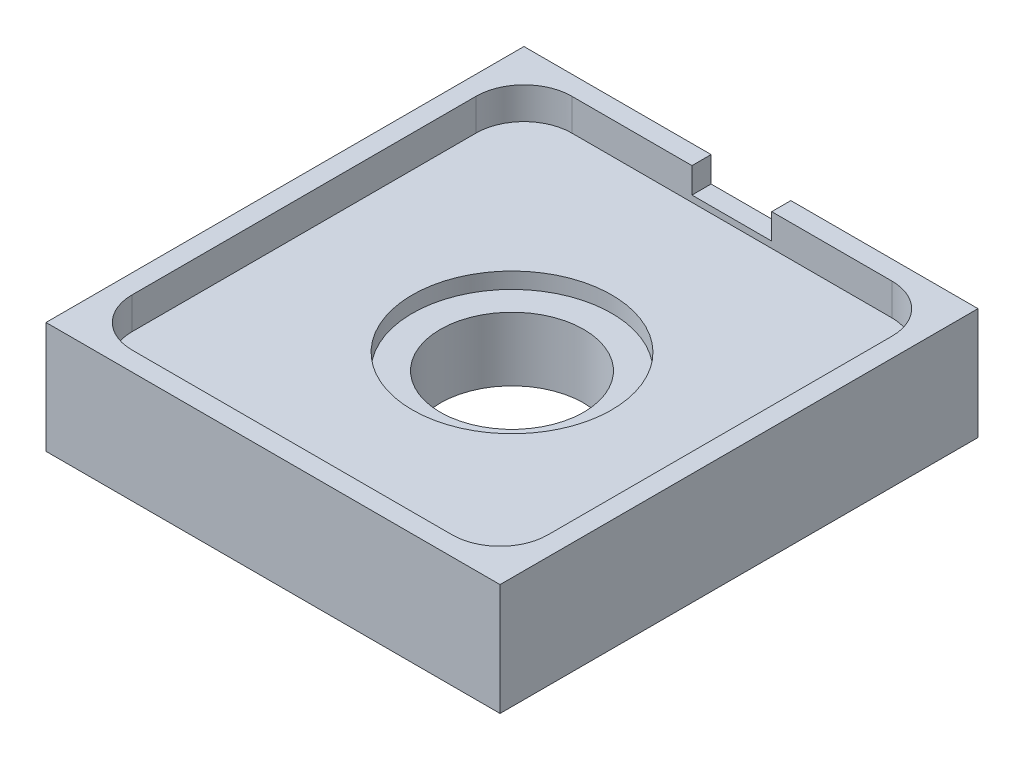
ISO-10303-21;
HEADER;
FILE_DESCRIPTION(('STEP AP214'),'2;1');
FILE_NAME('part.step','',(''),(''),'','','');
FILE_SCHEMA(('AUTOMOTIVE_DESIGN { 1 0 10303 214 1 1 1 1 }'));
ENDSEC;
DATA;
#1=APPLICATION_CONTEXT('core data for automotive mechanical design processes');
#2=APPLICATION_PROTOCOL_DEFINITION('international standard','automotive_design',2000,#1);
#3=PRODUCT_CONTEXT('',#1,'mechanical');
#4=PRODUCT('Part','Part','',(#3));
#5=PRODUCT_RELATED_PRODUCT_CATEGORY('part','',(#4));
#6=PRODUCT_DEFINITION_FORMATION('','',#4);
#7=PRODUCT_DEFINITION_CONTEXT('part definition',#1,'design');
#8=PRODUCT_DEFINITION('design','',#6,#7);
#9=PRODUCT_DEFINITION_SHAPE('','',#8);
#10=(LENGTH_UNIT() NAMED_UNIT(*) SI_UNIT(.MILLI.,.METRE.));
#11=(NAMED_UNIT(*) PLANE_ANGLE_UNIT() SI_UNIT($,.RADIAN.));
#12=(NAMED_UNIT(*) SI_UNIT($,.STERADIAN.) SOLID_ANGLE_UNIT());
#13=UNCERTAINTY_MEASURE_WITH_UNIT(LENGTH_MEASURE(1.E-05),#10,'distance_accuracy_value','');
#14=(GEOMETRIC_REPRESENTATION_CONTEXT(3) GLOBAL_UNCERTAINTY_ASSIGNED_CONTEXT((#13)) GLOBAL_UNIT_ASSIGNED_CONTEXT((#10,
#11,#12)) REPRESENTATION_CONTEXT('',''));
#15=CARTESIAN_POINT('',(0.,0.,0.));
#16=DIRECTION('',(0.,0.,1.));
#17=DIRECTION('',(1.,0.,0.));
#18=AXIS2_PLACEMENT_3D('',#15,#16,#17);
#19=CARTESIAN_POINT('',(0.,-5.001,0.));
#20=DIRECTION('',(0.,1.,0.));
#21=DIRECTION('',(0.,0.,1.));
#22=AXIS2_PLACEMENT_3D('',#19,#20,#21);
#23=CYLINDRICAL_SURFACE('',#22,4.5);
#24=CARTESIAN_POINT('',(0.,-5.,0.));
#25=DIRECTION('',(0.,1.,0.));
#26=DIRECTION('',(0.,0.,1.));
#27=AXIS2_PLACEMENT_3D('',#24,#25,#26);
#28=CIRCLE('',#27,4.5);
#29=CARTESIAN_POINT('',(0.,-5.,4.5));
#30=VERTEX_POINT('',#29);
#31=EDGE_CURVE('E206',#30,#30,#28,.F.);
#32=ORIENTED_EDGE('',*,*,#31,.T.);
#33=EDGE_LOOP('',(#32));
#34=FACE_BOUND('',#33,.T.);
#35=CARTESIAN_POINT('',(0.,-1.,0.));
#36=DIRECTION('',(0.,1.,0.));
#37=DIRECTION('',(0.,0.,1.));
#38=AXIS2_PLACEMENT_3D('',#35,#36,#37);
#39=CIRCLE('',#38,4.5);
#40=CARTESIAN_POINT('',(0.,-1.,4.5));
#41=VERTEX_POINT('',#40);
#42=EDGE_CURVE('E188',#41,#41,#39,.F.);
#43=ORIENTED_EDGE('',*,*,#42,.F.);
#44=EDGE_LOOP('',(#43));
#45=FACE_BOUND('',#44,.T.);
#46=ADVANCED_FACE('F34',(#34,#45),#23,.F.);
#47=CARTESIAN_POINT('',(14.235,-5.,-14.985));
#48=DIRECTION('',(1.,0.,0.));
#49=DIRECTION('',(0.,0.,-1.));
#50=AXIS2_PLACEMENT_3D('',#47,#48,#49);
#51=PLANE('',#50);
#52=DIRECTION('',(0.,1.,0.));
#53=VECTOR('',#52,1.);
#54=CARTESIAN_POINT('',(14.235,-5.,-14.985));
#55=LINE('',#54,#53);
#56=CARTESIAN_POINT('',(14.235,-5.,-14.985));
#57=VERTEX_POINT('',#56);
#58=CARTESIAN_POINT('',(14.235,2.,-14.985));
#59=VERTEX_POINT('',#58);
#60=EDGE_CURVE('E221',#57,#59,#55,.T.);
#61=ORIENTED_EDGE('',*,*,#60,.T.);
#62=DIRECTION('',(0.,0.,-1.));
#63=VECTOR('',#62,1.);
#64=CARTESIAN_POINT('',(14.235,2.,14.985));
#65=LINE('',#64,#63);
#66=CARTESIAN_POINT('',(14.235,2.,14.985));
#67=VERTEX_POINT('',#66);
#68=EDGE_CURVE('E199',#67,#59,#65,.T.);
#69=ORIENTED_EDGE('',*,*,#68,.F.);
#70=DIRECTION('',(0.,1.,0.));
#71=VECTOR('',#70,1.);
#72=CARTESIAN_POINT('',(14.235,-5.,14.985));
#73=LINE('',#72,#71);
#74=CARTESIAN_POINT('',(14.235,-5.,14.985));
#75=VERTEX_POINT('',#74);
#76=EDGE_CURVE('E222',#75,#67,#73,.T.);
#77=ORIENTED_EDGE('',*,*,#76,.F.);
#78=DIRECTION('',(0.,0.,-1.));
#79=VECTOR('',#78,1.);
#80=CARTESIAN_POINT('',(14.235,-5.,-14.985));
#81=LINE('',#80,#79);
#82=EDGE_CURVE('E209',#75,#57,#81,.T.);
#83=ORIENTED_EDGE('',*,*,#82,.T.);
#84=EDGE_LOOP('',(#61,#69,#77,#83));
#85=FACE_BOUND('',#84,.T.);
#86=ADVANCED_FACE('F315',(#85),#51,.T.);
#87=CARTESIAN_POINT('',(-14.235,-5.,14.985));
#88=DIRECTION('',(0.,0.,1.));
#89=DIRECTION('',(1.,0.,0.));
#90=AXIS2_PLACEMENT_3D('',#87,#88,#89);
#91=PLANE('',#90);
#92=ORIENTED_EDGE('',*,*,#76,.T.);
#93=DIRECTION('',(1.,0.,0.));
#94=VECTOR('',#93,1.);
#95=CARTESIAN_POINT('',(-14.235,2.,14.985));
#96=LINE('',#95,#94);
#97=CARTESIAN_POINT('',(-14.235,2.,14.985));
#98=VERTEX_POINT('',#97);
#99=EDGE_CURVE('E183',#98,#67,#96,.T.);
#100=ORIENTED_EDGE('',*,*,#99,.F.);
#101=DIRECTION('',(0.,1.,0.));
#102=VECTOR('',#101,1.);
#103=CARTESIAN_POINT('',(-14.235,-5.,14.985));
#104=LINE('',#103,#102);
#105=CARTESIAN_POINT('',(-14.235,-5.,14.985));
#106=VERTEX_POINT('',#105);
#107=EDGE_CURVE('E225',#106,#98,#104,.T.);
#108=ORIENTED_EDGE('',*,*,#107,.F.);
#109=DIRECTION('',(1.,0.,0.));
#110=VECTOR('',#109,1.);
#111=CARTESIAN_POINT('',(-14.235,-5.,14.985));
#112=LINE('',#111,#110);
#113=EDGE_CURVE('E218',#106,#75,#112,.T.);
#114=ORIENTED_EDGE('',*,*,#113,.T.);
#115=EDGE_LOOP('',(#92,#100,#108,#114));
#116=FACE_BOUND('',#115,.T.);
#117=ADVANCED_FACE('F310',(#116),#91,.T.);
#118=CARTESIAN_POINT('',(-14.235,-5.,-14.985));
#119=DIRECTION('',(-1.,0.,0.));
#120=DIRECTION('',(0.,0.,1.));
#121=AXIS2_PLACEMENT_3D('',#118,#119,#120);
#122=PLANE('',#121);
#123=ORIENTED_EDGE('',*,*,#107,.T.);
#124=DIRECTION('',(0.,0.,1.));
#125=VECTOR('',#124,1.);
#126=CARTESIAN_POINT('',(-14.235,2.,-14.985));
#127=LINE('',#126,#125);
#128=CARTESIAN_POINT('',(-14.235,2.,-14.985));
#129=VERTEX_POINT('',#128);
#130=EDGE_CURVE('E203',#129,#98,#127,.T.);
#131=ORIENTED_EDGE('',*,*,#130,.F.);
#132=DIRECTION('',(0.,1.,0.));
#133=VECTOR('',#132,1.);
#134=CARTESIAN_POINT('',(-14.235,-5.,-14.985));
#135=LINE('',#134,#133);
#136=CARTESIAN_POINT('',(-14.235,-5.,-14.985));
#137=VERTEX_POINT('',#136);
#138=EDGE_CURVE('E227',#137,#129,#135,.T.);
#139=ORIENTED_EDGE('',*,*,#138,.F.);
#140=DIRECTION('',(0.,0.,1.));
#141=VECTOR('',#140,1.);
#142=CARTESIAN_POINT('',(-14.235,-5.,-14.985));
#143=LINE('',#142,#141);
#144=EDGE_CURVE('E215',#137,#106,#143,.T.);
#145=ORIENTED_EDGE('',*,*,#144,.T.);
#146=EDGE_LOOP('',(#123,#131,#139,#145));
#147=FACE_BOUND('',#146,.T.);
#148=ADVANCED_FACE('F307',(#147),#122,.T.);
#149=CARTESIAN_POINT('',(-14.235,-5.,-14.985));
#150=DIRECTION('',(0.,0.,-1.));
#151=DIRECTION('',(-1.,0.,0.));
#152=AXIS2_PLACEMENT_3D('',#149,#150,#151);
#153=PLANE('',#152);
#154=DIRECTION('',(0.,-1.,0.));
#155=VECTOR('',#154,1.);
#156=CARTESIAN_POINT('',(2.5,2.,-14.985));
#157=LINE('',#156,#155);
#158=CARTESIAN_POINT('',(2.5,2.,-14.985));
#159=VERTEX_POINT('',#158);
#160=CARTESIAN_POINT('',(2.5,0.4,-14.985));
#161=VERTEX_POINT('',#160);
#162=EDGE_CURVE('E316',#159,#161,#157,.T.);
#163=ORIENTED_EDGE('',*,*,#162,.F.);
#164=DIRECTION('',(-1.,0.,0.));
#165=VECTOR('',#164,1.);
#166=CARTESIAN_POINT('',(14.235,2.,-14.985));
#167=LINE('',#166,#165);
#168=EDGE_CURVE('E165',#59,#159,#167,.T.);
#169=ORIENTED_EDGE('',*,*,#168,.F.);
#170=ORIENTED_EDGE('',*,*,#60,.F.);
#171=DIRECTION('',(-1.,0.,0.));
#172=VECTOR('',#171,1.);
#173=CARTESIAN_POINT('',(-14.235,-5.,-14.985));
#174=LINE('',#173,#172);
#175=EDGE_CURVE('E212',#57,#137,#174,.T.);
#176=ORIENTED_EDGE('',*,*,#175,.T.);
#177=ORIENTED_EDGE('',*,*,#138,.T.);
#178=CARTESIAN_POINT('',(-2.5,2.,-14.985));
#179=VERTEX_POINT('',#178);
#180=EDGE_CURVE('E201',#179,#129,#167,.T.);
#181=ORIENTED_EDGE('',*,*,#180,.F.);
#182=DIRECTION('',(0.,1.,0.));
#183=VECTOR('',#182,1.);
#184=CARTESIAN_POINT('',(-2.5,2.,-14.985));
#185=LINE('',#184,#183);
#186=CARTESIAN_POINT('',(-2.5,0.4,-14.985));
#187=VERTEX_POINT('',#186);
#188=EDGE_CURVE('E302',#187,#179,#185,.T.);
#189=ORIENTED_EDGE('',*,*,#188,.F.);
#190=DIRECTION('',(-1.,0.,0.));
#191=VECTOR('',#190,1.);
#192=CARTESIAN_POINT('',(-2.5,0.4,-14.985));
#193=LINE('',#192,#191);
#194=EDGE_CURVE('E166',#161,#187,#193,.T.);
#195=ORIENTED_EDGE('',*,*,#194,.F.);
#196=EDGE_LOOP('',(#163,#169,#170,#176,#177,#181,#189,#195));
#197=FACE_BOUND('',#196,.T.);
#198=ADVANCED_FACE('F300',(#197),#153,.T.);
#199=CARTESIAN_POINT('',(0.,-5.,0.));
#200=DIRECTION('',(0.,1.,0.));
#201=DIRECTION('',(0.,0.,1.));
#202=AXIS2_PLACEMENT_3D('',#199,#200,#201);
#203=PLANE('',#202);
#204=ORIENTED_EDGE('',*,*,#31,.F.);
#205=EDGE_LOOP('',(#204));
#206=FACE_BOUND('',#205,.T.);
#207=ORIENTED_EDGE('',*,*,#82,.F.);
#208=ORIENTED_EDGE('',*,*,#113,.F.);
#209=ORIENTED_EDGE('',*,*,#144,.F.);
#210=ORIENTED_EDGE('',*,*,#175,.F.);
#211=EDGE_LOOP('',(#207,#208,#209,#210));
#212=FACE_BOUND('',#211,.T.);
#213=ADVANCED_FACE('F335',(#206,#212),#203,.F.);
#214=CARTESIAN_POINT('',(0.,0.,0.));
#215=DIRECTION('',(0.,1.,0.));
#216=DIRECTION('',(0.,0.,1.));
#217=AXIS2_PLACEMENT_3D('',#214,#215,#216);
#218=PLANE('',#217);
#219=CARTESIAN_POINT('',(0.,0.,0.));
#220=DIRECTION('',(0.,1.,0.));
#221=DIRECTION('',(0.,0.,1.));
#222=AXIS2_PLACEMENT_3D('',#219,#220,#221);
#223=CIRCLE('',#222,6.25);
#224=CARTESIAN_POINT('',(0.,0.,6.25));
#225=VERTEX_POINT('',#224);
#226=EDGE_CURVE('E295',#225,#225,#223,.T.);
#227=ORIENTED_EDGE('',*,*,#226,.F.);
#228=EDGE_LOOP('',(#227));
#229=FACE_BOUND('',#228,.T.);
#230=DIRECTION('',(0.,0.,-1.));
#231=VECTOR('',#230,1.);
#232=CARTESIAN_POINT('',(13.035,0.,13.785));
#233=LINE('',#232,#231);
#234=CARTESIAN_POINT('',(13.035,0.,10.785));
#235=VERTEX_POINT('',#234);
#236=CARTESIAN_POINT('',(13.035,0.,-10.785));
#237=VERTEX_POINT('',#236);
#238=EDGE_CURVE('E184',#235,#237,#233,.T.);
#239=ORIENTED_EDGE('',*,*,#238,.T.);
#240=CARTESIAN_POINT('',(10.035,0.,-10.785));
#241=DIRECTION('',(0.,1.,0.));
#242=DIRECTION('',(0.,0.,1.));
#243=AXIS2_PLACEMENT_3D('',#240,#241,#242);
#244=CIRCLE('',#243,3.);
#245=CARTESIAN_POINT('',(10.035,0.,-13.785));
#246=VERTEX_POINT('',#245);
#247=EDGE_CURVE('E244',#237,#246,#244,.T.);
#248=ORIENTED_EDGE('',*,*,#247,.T.);
#249=DIRECTION('',(-1.,0.,0.));
#250=VECTOR('',#249,1.);
#251=CARTESIAN_POINT('',(-13.035,0.,-13.785));
#252=LINE('',#251,#250);
#253=CARTESIAN_POINT('',(-10.035,0.,-13.785));
#254=VERTEX_POINT('',#253);
#255=EDGE_CURVE('E187',#246,#254,#252,.T.);
#256=ORIENTED_EDGE('',*,*,#255,.T.);
#257=CARTESIAN_POINT('',(-10.035,0.,-10.785));
#258=DIRECTION('',(0.,1.,0.));
#259=DIRECTION('',(0.,0.,1.));
#260=AXIS2_PLACEMENT_3D('',#257,#258,#259);
#261=CIRCLE('',#260,3.);
#262=CARTESIAN_POINT('',(-13.035,0.,-10.785));
#263=VERTEX_POINT('',#262);
#264=EDGE_CURVE('E242',#254,#263,#261,.T.);
#265=ORIENTED_EDGE('',*,*,#264,.T.);
#266=DIRECTION('',(0.,0.,1.));
#267=VECTOR('',#266,1.);
#268=CARTESIAN_POINT('',(-13.035,0.,13.785));
#269=LINE('',#268,#267);
#270=CARTESIAN_POINT('',(-13.035,0.,10.785));
#271=VERTEX_POINT('',#270);
#272=EDGE_CURVE('E191',#263,#271,#269,.T.);
#273=ORIENTED_EDGE('',*,*,#272,.T.);
#274=CARTESIAN_POINT('',(-10.035,0.,10.785));
#275=DIRECTION('',(0.,1.,0.));
#276=DIRECTION('',(0.,0.,1.));
#277=AXIS2_PLACEMENT_3D('',#274,#275,#276);
#278=CIRCLE('',#277,3.);
#279=CARTESIAN_POINT('',(-10.035,0.,13.785));
#280=VERTEX_POINT('',#279);
#281=EDGE_CURVE('E240',#271,#280,#278,.T.);
#282=ORIENTED_EDGE('',*,*,#281,.T.);
#283=DIRECTION('',(1.,0.,0.));
#284=VECTOR('',#283,1.);
#285=CARTESIAN_POINT('',(-13.035,0.,13.785));
#286=LINE('',#285,#284);
#287=CARTESIAN_POINT('',(10.035,0.,13.785));
#288=VERTEX_POINT('',#287);
#289=EDGE_CURVE('E194',#280,#288,#286,.T.);
#290=ORIENTED_EDGE('',*,*,#289,.T.);
#291=CARTESIAN_POINT('',(10.035,0.,10.785));
#292=DIRECTION('',(0.,1.,0.));
#293=DIRECTION('',(0.,0.,1.));
#294=AXIS2_PLACEMENT_3D('',#291,#292,#293);
#295=CIRCLE('',#294,3.);
#296=EDGE_CURVE('E238',#288,#235,#295,.T.);
#297=ORIENTED_EDGE('',*,*,#296,.T.);
#298=EDGE_LOOP('',(#239,#248,#256,#265,#273,#282,#290,#297));
#299=FACE_BOUND('',#298,.T.);
#300=ADVANCED_FACE('F277',(#229,#299),#218,.T.);
#301=CARTESIAN_POINT('',(0.,2.,0.));
#302=DIRECTION('',(0.,1.,0.));
#303=DIRECTION('',(0.,0.,1.));
#304=AXIS2_PLACEMENT_3D('',#301,#302,#303);
#305=PLANE('',#304);
#306=DIRECTION('',(0.,0.,-1.));
#307=VECTOR('',#306,1.);
#308=CARTESIAN_POINT('',(2.5,2.,-8.53523810063733));
#309=LINE('',#308,#307);
#310=CARTESIAN_POINT('',(2.5,2.,-13.785));
#311=VERTEX_POINT('',#310);
#312=EDGE_CURVE('E151',#311,#159,#309,.T.);
#313=ORIENTED_EDGE('',*,*,#312,.F.);
#314=DIRECTION('',(-1.,0.,0.));
#315=VECTOR('',#314,1.);
#316=CARTESIAN_POINT('',(-13.035,2.,-13.785));
#317=LINE('',#316,#315);
#318=CARTESIAN_POINT('',(10.035,2.,-13.785));
#319=VERTEX_POINT('',#318);
#320=EDGE_CURVE('E161',#319,#311,#317,.T.);
#321=ORIENTED_EDGE('',*,*,#320,.F.);
#322=CARTESIAN_POINT('',(10.035,2.,-10.785));
#323=DIRECTION('',(0.,1.,0.));
#324=DIRECTION('',(0.,0.,1.));
#325=AXIS2_PLACEMENT_3D('',#322,#323,#324);
#326=CIRCLE('',#325,3.);
#327=CARTESIAN_POINT('',(13.035,2.,-10.785));
#328=VERTEX_POINT('',#327);
#329=EDGE_CURVE('E260',#319,#328,#326,.F.);
#330=ORIENTED_EDGE('',*,*,#329,.T.);
#331=DIRECTION('',(0.,0.,-1.));
#332=VECTOR('',#331,1.);
#333=CARTESIAN_POINT('',(13.035,2.,13.785));
#334=LINE('',#333,#332);
#335=CARTESIAN_POINT('',(13.035,2.,10.785));
#336=VERTEX_POINT('',#335);
#337=EDGE_CURVE('E178',#336,#328,#334,.T.);
#338=ORIENTED_EDGE('',*,*,#337,.F.);
#339=CARTESIAN_POINT('',(10.035,2.,10.785));
#340=DIRECTION('',(0.,1.,0.));
#341=DIRECTION('',(0.,0.,1.));
#342=AXIS2_PLACEMENT_3D('',#339,#340,#341);
#343=CIRCLE('',#342,3.);
#344=CARTESIAN_POINT('',(10.035,2.,13.785));
#345=VERTEX_POINT('',#344);
#346=EDGE_CURVE('E11',#336,#345,#343,.F.);
#347=ORIENTED_EDGE('',*,*,#346,.T.);
#348=DIRECTION('',(1.,0.,0.));
#349=VECTOR('',#348,1.);
#350=CARTESIAN_POINT('',(-13.035,2.,13.785));
#351=LINE('',#350,#349);
#352=CARTESIAN_POINT('',(-10.035,2.,13.785));
#353=VERTEX_POINT('',#352);
#354=EDGE_CURVE('E176',#353,#345,#351,.T.);
#355=ORIENTED_EDGE('',*,*,#354,.F.);
#356=CARTESIAN_POINT('',(-10.035,2.,10.785));
#357=DIRECTION('',(0.,1.,0.));
#358=DIRECTION('',(0.,0.,1.));
#359=AXIS2_PLACEMENT_3D('',#356,#357,#358);
#360=CIRCLE('',#359,3.);
#361=CARTESIAN_POINT('',(-13.035,2.,10.785));
#362=VERTEX_POINT('',#361);
#363=EDGE_CURVE('E42',#353,#362,#360,.F.);
#364=ORIENTED_EDGE('',*,*,#363,.T.);
#365=DIRECTION('',(0.,0.,1.));
#366=VECTOR('',#365,1.);
#367=CARTESIAN_POINT('',(-13.035,2.,13.785));
#368=LINE('',#367,#366);
#369=CARTESIAN_POINT('',(-13.035,2.,-10.785));
#370=VERTEX_POINT('',#369);
#371=EDGE_CURVE('E172',#370,#362,#368,.T.);
#372=ORIENTED_EDGE('',*,*,#371,.F.);
#373=CARTESIAN_POINT('',(-10.035,2.,-10.785));
#374=DIRECTION('',(0.,1.,0.));
#375=DIRECTION('',(0.,0.,1.));
#376=AXIS2_PLACEMENT_3D('',#373,#374,#375);
#377=CIRCLE('',#376,3.);
#378=CARTESIAN_POINT('',(-10.035,2.,-13.785));
#379=VERTEX_POINT('',#378);
#380=EDGE_CURVE('E262',#370,#379,#377,.F.);
#381=ORIENTED_EDGE('',*,*,#380,.T.);
#382=CARTESIAN_POINT('',(-2.5,2.,-13.785));
#383=VERTEX_POINT('',#382);
#384=EDGE_CURVE('E173',#383,#379,#317,.T.);
#385=ORIENTED_EDGE('',*,*,#384,.F.);
#386=DIRECTION('',(0.,0.,-1.));
#387=VECTOR('',#386,1.);
#388=CARTESIAN_POINT('',(-2.5,2.,-8.53523810063733));
#389=LINE('',#388,#387);
#390=EDGE_CURVE('E49',#383,#179,#389,.T.);
#391=ORIENTED_EDGE('',*,*,#390,.T.);
#392=ORIENTED_EDGE('',*,*,#180,.T.);
#393=ORIENTED_EDGE('',*,*,#130,.T.);
#394=ORIENTED_EDGE('',*,*,#99,.T.);
#395=ORIENTED_EDGE('',*,*,#68,.T.);
#396=ORIENTED_EDGE('',*,*,#168,.T.);
#397=EDGE_LOOP('',(#313,#321,#330,#338,#347,#355,#364,#372,#381,#385,#391,#392,#393,#394,#395,#396));
#398=FACE_BOUND('',#397,.T.);
#399=ADVANCED_FACE('F160',(#398),#305,.T.);
#400=CARTESIAN_POINT('',(13.035,2.,13.785));
#401=DIRECTION('',(-1.,0.,0.));
#402=DIRECTION('',(0.,0.,1.));
#403=AXIS2_PLACEMENT_3D('',#400,#401,#402);
#404=PLANE('',#403);
#405=ORIENTED_EDGE('',*,*,#337,.T.);
#406=DIRECTION('',(0.,-1.,0.));
#407=VECTOR('',#406,1.);
#408=CARTESIAN_POINT('',(13.035,0.,-10.785));
#409=LINE('',#408,#407);
#410=EDGE_CURVE('E235',#328,#237,#409,.T.);
#411=ORIENTED_EDGE('',*,*,#410,.T.);
#412=ORIENTED_EDGE('',*,*,#238,.F.);
#413=DIRECTION('',(0.,-1.,0.));
#414=VECTOR('',#413,1.);
#415=CARTESIAN_POINT('',(13.035,2.,10.785));
#416=LINE('',#415,#414);
#417=EDGE_CURVE('E224',#235,#336,#416,.F.);
#418=ORIENTED_EDGE('',*,*,#417,.T.);
#419=EDGE_LOOP('',(#405,#411,#412,#418));
#420=FACE_BOUND('',#419,.T.);
#421=ADVANCED_FACE('F286',(#420),#404,.T.);
#422=CARTESIAN_POINT('',(-13.035,2.,-13.785));
#423=DIRECTION('',(0.,0.,1.));
#424=DIRECTION('',(1.,0.,0.));
#425=AXIS2_PLACEMENT_3D('',#422,#423,#424);
#426=PLANE('',#425);
#427=DIRECTION('',(0.,-1.,0.));
#428=VECTOR('',#427,1.);
#429=CARTESIAN_POINT('',(2.5,2.,-13.785));
#430=LINE('',#429,#428);
#431=CARTESIAN_POINT('',(2.5,0.4,-13.785));
#432=VERTEX_POINT('',#431);
#433=EDGE_CURVE('E147',#311,#432,#430,.T.);
#434=ORIENTED_EDGE('',*,*,#433,.T.);
#435=DIRECTION('',(-1.,0.,0.));
#436=VECTOR('',#435,1.);
#437=CARTESIAN_POINT('',(-2.5,0.4,-13.785));
#438=LINE('',#437,#436);
#439=CARTESIAN_POINT('',(-2.5,0.4,-13.785));
#440=VERTEX_POINT('',#439);
#441=EDGE_CURVE('E324',#432,#440,#438,.T.);
#442=ORIENTED_EDGE('',*,*,#441,.T.);
#443=DIRECTION('',(0.,1.,0.));
#444=VECTOR('',#443,1.);
#445=CARTESIAN_POINT('',(-2.5,2.,-13.785));
#446=LINE('',#445,#444);
#447=EDGE_CURVE('E296',#440,#383,#446,.T.);
#448=ORIENTED_EDGE('',*,*,#447,.T.);
#449=ORIENTED_EDGE('',*,*,#384,.T.);
#450=DIRECTION('',(0.,-1.,0.));
#451=VECTOR('',#450,1.);
#452=CARTESIAN_POINT('',(-10.035,0.,-13.785));
#453=LINE('',#452,#451);
#454=EDGE_CURVE('E246',#379,#254,#453,.T.);
#455=ORIENTED_EDGE('',*,*,#454,.T.);
#456=ORIENTED_EDGE('',*,*,#255,.F.);
#457=DIRECTION('',(0.,-1.,0.));
#458=VECTOR('',#457,1.);
#459=CARTESIAN_POINT('',(10.035,2.,-13.785));
#460=LINE('',#459,#458);
#461=EDGE_CURVE('E171',#246,#319,#460,.F.);
#462=ORIENTED_EDGE('',*,*,#461,.T.);
#463=ORIENTED_EDGE('',*,*,#320,.T.);
#464=EDGE_LOOP('',(#434,#442,#448,#449,#455,#456,#462,#463));
#465=FACE_BOUND('',#464,.T.);
#466=ADVANCED_FACE('F168',(#465),#426,.T.);
#467=CARTESIAN_POINT('',(-13.035,2.,13.785));
#468=DIRECTION('',(1.,0.,0.));
#469=DIRECTION('',(0.,0.,-1.));
#470=AXIS2_PLACEMENT_3D('',#467,#468,#469);
#471=PLANE('',#470);
#472=ORIENTED_EDGE('',*,*,#272,.F.);
#473=DIRECTION('',(0.,-1.,0.));
#474=VECTOR('',#473,1.);
#475=CARTESIAN_POINT('',(-13.035,2.,-10.785));
#476=LINE('',#475,#474);
#477=EDGE_CURVE('E253',#263,#370,#476,.F.);
#478=ORIENTED_EDGE('',*,*,#477,.T.);
#479=ORIENTED_EDGE('',*,*,#371,.T.);
#480=DIRECTION('',(0.,-1.,0.));
#481=VECTOR('',#480,1.);
#482=CARTESIAN_POINT('',(-13.035,0.,10.785));
#483=LINE('',#482,#481);
#484=EDGE_CURVE('E250',#362,#271,#483,.T.);
#485=ORIENTED_EDGE('',*,*,#484,.T.);
#486=EDGE_LOOP('',(#472,#478,#479,#485));
#487=FACE_BOUND('',#486,.T.);
#488=ADVANCED_FACE('F272',(#487),#471,.T.);
#489=CARTESIAN_POINT('',(-13.035,2.,13.785));
#490=DIRECTION('',(0.,0.,-1.));
#491=DIRECTION('',(-1.,0.,0.));
#492=AXIS2_PLACEMENT_3D('',#489,#490,#491);
#493=PLANE('',#492);
#494=ORIENTED_EDGE('',*,*,#289,.F.);
#495=DIRECTION('',(0.,-1.,0.));
#496=VECTOR('',#495,1.);
#497=CARTESIAN_POINT('',(-10.035,2.,13.785));
#498=LINE('',#497,#496);
#499=EDGE_CURVE('E258',#280,#353,#498,.F.);
#500=ORIENTED_EDGE('',*,*,#499,.T.);
#501=ORIENTED_EDGE('',*,*,#354,.T.);
#502=DIRECTION('',(0.,-1.,0.));
#503=VECTOR('',#502,1.);
#504=CARTESIAN_POINT('',(10.035,0.,13.785));
#505=LINE('',#504,#503);
#506=EDGE_CURVE('E255',#345,#288,#505,.T.);
#507=ORIENTED_EDGE('',*,*,#506,.T.);
#508=EDGE_LOOP('',(#494,#500,#501,#507));
#509=FACE_BOUND('',#508,.T.);
#510=ADVANCED_FACE('F279',(#509),#493,.T.);
#511=CARTESIAN_POINT('',(0.,-1.,0.));
#512=DIRECTION('',(0.,1.,0.));
#513=DIRECTION('',(0.,0.,1.));
#514=AXIS2_PLACEMENT_3D('',#511,#512,#513);
#515=PLANE('',#514);
#516=CARTESIAN_POINT('',(0.,-1.,0.));
#517=DIRECTION('',(0.,1.,0.));
#518=DIRECTION('',(0.,0.,1.));
#519=AXIS2_PLACEMENT_3D('',#516,#517,#518);
#520=CIRCLE('',#519,6.25);
#521=CARTESIAN_POINT('',(0.,-1.,6.25));
#522=VERTEX_POINT('',#521);
#523=EDGE_CURVE('E233',#522,#522,#520,.T.);
#524=ORIENTED_EDGE('',*,*,#523,.T.);
#525=EDGE_LOOP('',(#524));
#526=FACE_BOUND('',#525,.T.);
#527=ORIENTED_EDGE('',*,*,#42,.T.);
#528=EDGE_LOOP('',(#527));
#529=FACE_BOUND('',#528,.T.);
#530=ADVANCED_FACE('F362',(#526,#529),#515,.T.);
#531=CARTESIAN_POINT('',(0.,-1.,0.));
#532=DIRECTION('',(0.,1.,0.));
#533=DIRECTION('',(0.,0.,1.));
#534=AXIS2_PLACEMENT_3D('',#531,#532,#533);
#535=CYLINDRICAL_SURFACE('',#534,6.25);
#536=ORIENTED_EDGE('',*,*,#523,.F.);
#537=EDGE_LOOP('',(#536));
#538=FACE_BOUND('',#537,.T.);
#539=ORIENTED_EDGE('',*,*,#226,.T.);
#540=EDGE_LOOP('',(#539));
#541=FACE_BOUND('',#540,.T.);
#542=ADVANCED_FACE('F332',(#538,#541),#535,.F.);
#543=CARTESIAN_POINT('',(10.035,2.,-10.785));
#544=DIRECTION('',(0.,1.,0.));
#545=DIRECTION('',(0.,0.,1.));
#546=AXIS2_PLACEMENT_3D('',#543,#544,#545);
#547=CYLINDRICAL_SURFACE('',#546,3.);
#548=ORIENTED_EDGE('',*,*,#329,.F.);
#549=ORIENTED_EDGE('',*,*,#461,.F.);
#550=ORIENTED_EDGE('',*,*,#247,.F.);
#551=ORIENTED_EDGE('',*,*,#410,.F.);
#552=EDGE_LOOP('',(#548,#549,#550,#551));
#553=FACE_BOUND('',#552,.T.);
#554=ADVANCED_FACE('F289',(#553),#547,.F.);
#555=CARTESIAN_POINT('',(-10.035,2.,-10.785));
#556=DIRECTION('',(0.,1.,0.));
#557=DIRECTION('',(0.,0.,1.));
#558=AXIS2_PLACEMENT_3D('',#555,#556,#557);
#559=CYLINDRICAL_SURFACE('',#558,3.);
#560=ORIENTED_EDGE('',*,*,#380,.F.);
#561=ORIENTED_EDGE('',*,*,#477,.F.);
#562=ORIENTED_EDGE('',*,*,#264,.F.);
#563=ORIENTED_EDGE('',*,*,#454,.F.);
#564=EDGE_LOOP('',(#560,#561,#562,#563));
#565=FACE_BOUND('',#564,.T.);
#566=ADVANCED_FACE('F293',(#565),#559,.F.);
#567=CARTESIAN_POINT('',(-10.035,2.,10.785));
#568=DIRECTION('',(0.,1.,0.));
#569=DIRECTION('',(0.,0.,1.));
#570=AXIS2_PLACEMENT_3D('',#567,#568,#569);
#571=CYLINDRICAL_SURFACE('',#570,3.);
#572=ORIENTED_EDGE('',*,*,#363,.F.);
#573=ORIENTED_EDGE('',*,*,#499,.F.);
#574=ORIENTED_EDGE('',*,*,#281,.F.);
#575=ORIENTED_EDGE('',*,*,#484,.F.);
#576=EDGE_LOOP('',(#572,#573,#574,#575));
#577=FACE_BOUND('',#576,.T.);
#578=ADVANCED_FACE('F274',(#577),#571,.F.);
#579=CARTESIAN_POINT('',(10.035,2.,10.785));
#580=DIRECTION('',(0.,1.,0.));
#581=DIRECTION('',(0.,0.,1.));
#582=AXIS2_PLACEMENT_3D('',#579,#580,#581);
#583=CYLINDRICAL_SURFACE('',#582,3.);
#584=ORIENTED_EDGE('',*,*,#346,.F.);
#585=ORIENTED_EDGE('',*,*,#417,.F.);
#586=ORIENTED_EDGE('',*,*,#296,.F.);
#587=ORIENTED_EDGE('',*,*,#506,.F.);
#588=EDGE_LOOP('',(#584,#585,#586,#587));
#589=FACE_BOUND('',#588,.T.);
#590=ADVANCED_FACE('F36',(#589),#583,.F.);
#591=CARTESIAN_POINT('',(2.5,2.,-8.53523810063733));
#592=DIRECTION('',(1.,0.,0.));
#593=DIRECTION('',(0.,1.,0.));
#594=AXIS2_PLACEMENT_3D('',#591,#592,#593);
#595=PLANE('',#594);
#596=ORIENTED_EDGE('',*,*,#312,.T.);
#597=ORIENTED_EDGE('',*,*,#162,.T.);
#598=DIRECTION('',(0.,0.,-1.));
#599=VECTOR('',#598,1.);
#600=CARTESIAN_POINT('',(2.5,0.4,-8.53523810063733));
#601=LINE('',#600,#599);
#602=EDGE_CURVE('E153',#432,#161,#601,.T.);
#603=ORIENTED_EDGE('',*,*,#602,.F.);
#604=ORIENTED_EDGE('',*,*,#433,.F.);
#605=EDGE_LOOP('',(#596,#597,#603,#604));
#606=FACE_BOUND('',#605,.T.);
#607=ADVANCED_FACE('F149',(#606),#595,.F.);
#608=CARTESIAN_POINT('',(-2.5,0.4,-8.53523810063733));
#609=DIRECTION('',(0.,-1.,0.));
#610=DIRECTION('',(1.,0.,0.));
#611=AXIS2_PLACEMENT_3D('',#608,#609,#610);
#612=PLANE('',#611);
#613=ORIENTED_EDGE('',*,*,#602,.T.);
#614=ORIENTED_EDGE('',*,*,#194,.T.);
#615=DIRECTION('',(0.,0.,-1.));
#616=VECTOR('',#615,1.);
#617=CARTESIAN_POINT('',(-2.5,0.4,-8.53523810063733));
#618=LINE('',#617,#616);
#619=EDGE_CURVE('E323',#440,#187,#618,.T.);
#620=ORIENTED_EDGE('',*,*,#619,.F.);
#621=ORIENTED_EDGE('',*,*,#441,.F.);
#622=EDGE_LOOP('',(#613,#614,#620,#621));
#623=FACE_BOUND('',#622,.T.);
#624=ADVANCED_FACE('F371',(#623),#612,.F.);
#625=CARTESIAN_POINT('',(-2.5,2.,-8.53523810063733));
#626=DIRECTION('',(-1.,0.,0.));
#627=DIRECTION('',(0.,-1.,0.));
#628=AXIS2_PLACEMENT_3D('',#625,#626,#627);
#629=PLANE('',#628);
#630=ORIENTED_EDGE('',*,*,#619,.T.);
#631=ORIENTED_EDGE('',*,*,#188,.T.);
#632=ORIENTED_EDGE('',*,*,#390,.F.);
#633=ORIENTED_EDGE('',*,*,#447,.F.);
#634=EDGE_LOOP('',(#630,#631,#632,#633));
#635=FACE_BOUND('',#634,.T.);
#636=ADVANCED_FACE('F374',(#635),#629,.F.);
#637=CLOSED_SHELL('',(#46,#86,#117,#148,#198,#213,#300,#399,#421,#466,#488,#510,#530,#542,#554,
#566,#578,#590,#607,#624,#636));
#638=MANIFOLD_SOLID_BREP('B2',#637);
#639=ADVANCED_BREP_SHAPE_REPRESENTATION('',(#18,#638),#14);
#640=SHAPE_DEFINITION_REPRESENTATION(#9,#639);
ENDSEC;
END-ISO-10303-21;
